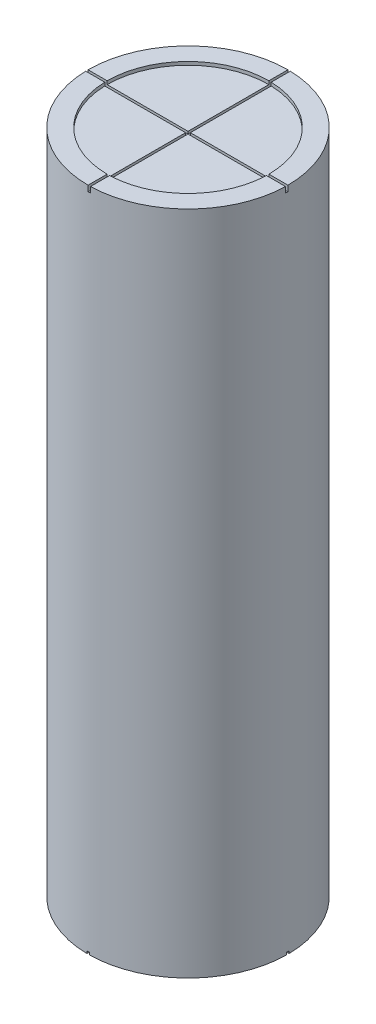
ISO-10303-21;
HEADER;
FILE_DESCRIPTION(('STEP AP214'),'2;1');
FILE_NAME('part.step','',(''),(''),'','','');
FILE_SCHEMA(('AUTOMOTIVE_DESIGN { 1 0 10303 214 1 1 1 1 }'));
ENDSEC;
DATA;
#1=APPLICATION_CONTEXT('core data for automotive mechanical design processes');
#2=APPLICATION_PROTOCOL_DEFINITION('international standard','automotive_design',2000,#1);
#3=PRODUCT_CONTEXT('',#1,'mechanical');
#4=PRODUCT('Part','Part','',(#3));
#5=PRODUCT_RELATED_PRODUCT_CATEGORY('part','',(#4));
#6=PRODUCT_DEFINITION_FORMATION('','',#4);
#7=PRODUCT_DEFINITION_CONTEXT('part definition',#1,'design');
#8=PRODUCT_DEFINITION('design','',#6,#7);
#9=PRODUCT_DEFINITION_SHAPE('','',#8);
#10=(LENGTH_UNIT() NAMED_UNIT(*) SI_UNIT(.MILLI.,.METRE.));
#11=(NAMED_UNIT(*) PLANE_ANGLE_UNIT() SI_UNIT($,.RADIAN.));
#12=(NAMED_UNIT(*) SI_UNIT($,.STERADIAN.) SOLID_ANGLE_UNIT());
#13=UNCERTAINTY_MEASURE_WITH_UNIT(LENGTH_MEASURE(1.E-05),#10,'distance_accuracy_value','');
#14=(GEOMETRIC_REPRESENTATION_CONTEXT(3) GLOBAL_UNCERTAINTY_ASSIGNED_CONTEXT((#13)) GLOBAL_UNIT_ASSIGNED_CONTEXT((#10,
#11,#12)) REPRESENTATION_CONTEXT('',''));
#15=CARTESIAN_POINT('',(0.,0.,0.));
#16=DIRECTION('',(0.,0.,1.));
#17=DIRECTION('',(1.,0.,0.));
#18=AXIS2_PLACEMENT_3D('',#15,#16,#17);
#19=CARTESIAN_POINT('',(0.,70.,0.));
#20=DIRECTION('',(0.,-1.,0.));
#21=DIRECTION('',(0.,0.,-1.));
#22=AXIS2_PLACEMENT_3D('',#19,#20,#21);
#23=CYLINDRICAL_SURFACE('',#22,10.5);
#24=DIRECTION('',(0.,-1.,0.));
#25=VECTOR('',#24,1.);
#26=CARTESIAN_POINT('',(10.4992559260169,70.,0.125));
#27=LINE('',#26,#25);
#28=CARTESIAN_POINT('',(10.4992559260169,0.25,0.125));
#29=VERTEX_POINT('',#28);
#30=CARTESIAN_POINT('',(10.4992559260169,0.,0.125));
#31=VERTEX_POINT('',#30);
#32=EDGE_CURVE('E480',#29,#31,#27,.T.);
#33=ORIENTED_EDGE('',*,*,#32,.F.);
#34=CARTESIAN_POINT('',(0.,0.25,0.));
#35=DIRECTION('',(0.,-1.,0.));
#36=DIRECTION('',(0.,0.,-1.));
#37=AXIS2_PLACEMENT_3D('',#34,#35,#36);
#38=CIRCLE('',#37,10.5);
#39=CARTESIAN_POINT('',(10.4992559260169,0.25,-0.125));
#40=VERTEX_POINT('',#39);
#41=EDGE_CURVE('E523',#40,#29,#38,.T.);
#42=ORIENTED_EDGE('',*,*,#41,.F.);
#43=DIRECTION('',(0.,-1.,0.));
#44=VECTOR('',#43,1.);
#45=CARTESIAN_POINT('',(10.4992559260169,70.,-0.125));
#46=LINE('',#45,#44);
#47=CARTESIAN_POINT('',(10.4992559260169,0.,-0.125));
#48=VERTEX_POINT('',#47);
#49=EDGE_CURVE('E476',#40,#48,#46,.T.);
#50=ORIENTED_EDGE('',*,*,#49,.T.);
#51=CARTESIAN_POINT('',(0.,0.,0.));
#52=DIRECTION('',(0.,1.,0.));
#53=DIRECTION('',(0.,0.,1.));
#54=AXIS2_PLACEMENT_3D('',#51,#52,#53);
#55=CIRCLE('',#54,10.5);
#56=CARTESIAN_POINT('',(0.125,0.,-10.4992559260169));
#57=VERTEX_POINT('',#56);
#58=EDGE_CURVE('E635',#48,#57,#55,.T.);
#59=ORIENTED_EDGE('',*,*,#58,.T.);
#60=DIRECTION('',(0.,-1.,0.));
#61=VECTOR('',#60,1.);
#62=CARTESIAN_POINT('',(0.125,70.,-10.4992559260169));
#63=LINE('',#62,#61);
#64=CARTESIAN_POINT('',(0.125,0.25,-10.4992559260169));
#65=VERTEX_POINT('',#64);
#66=EDGE_CURVE('E461',#65,#57,#63,.T.);
#67=ORIENTED_EDGE('',*,*,#66,.F.);
#68=CARTESIAN_POINT('',(-0.125,0.25,-10.4992559260169));
#69=VERTEX_POINT('',#68);
#70=EDGE_CURVE('E522',#69,#65,#38,.T.);
#71=ORIENTED_EDGE('',*,*,#70,.F.);
#72=DIRECTION('',(0.,-1.,0.));
#73=VECTOR('',#72,1.);
#74=CARTESIAN_POINT('',(-0.125,70.,-10.4992559260169));
#75=LINE('',#74,#73);
#76=CARTESIAN_POINT('',(-0.125,0.,-10.4992559260169));
#77=VERTEX_POINT('',#76);
#78=EDGE_CURVE('E464',#69,#77,#75,.T.);
#79=ORIENTED_EDGE('',*,*,#78,.T.);
#80=CARTESIAN_POINT('',(-10.4992559260169,0.,-0.125));
#81=VERTEX_POINT('',#80);
#82=EDGE_CURVE('E505',#77,#81,#55,.T.);
#83=ORIENTED_EDGE('',*,*,#82,.T.);
#84=DIRECTION('',(0.,-1.,0.));
#85=VECTOR('',#84,1.);
#86=CARTESIAN_POINT('',(-10.4992559260169,70.,-0.125));
#87=LINE('',#86,#85);
#88=CARTESIAN_POINT('',(-10.4992559260169,0.25,-0.125));
#89=VERTEX_POINT('',#88);
#90=EDGE_CURVE('E468',#81,#89,#87,.F.);
#91=ORIENTED_EDGE('',*,*,#90,.T.);
#92=CARTESIAN_POINT('',(-10.4992559260169,0.25,0.125));
#93=VERTEX_POINT('',#92);
#94=EDGE_CURVE('E705',#93,#89,#38,.T.);
#95=ORIENTED_EDGE('',*,*,#94,.F.);
#96=DIRECTION('',(0.,-1.,0.));
#97=VECTOR('',#96,1.);
#98=CARTESIAN_POINT('',(-10.4992559260169,70.,0.125));
#99=LINE('',#98,#97);
#100=CARTESIAN_POINT('',(-10.4992559260169,0.,0.125));
#101=VERTEX_POINT('',#100);
#102=EDGE_CURVE('E472',#101,#93,#99,.F.);
#103=ORIENTED_EDGE('',*,*,#102,.F.);
#104=CARTESIAN_POINT('',(-0.125,0.,10.4992559260169));
#105=VERTEX_POINT('',#104);
#106=EDGE_CURVE('E501',#101,#105,#55,.T.);
#107=ORIENTED_EDGE('',*,*,#106,.T.);
#108=DIRECTION('',(0.,-1.,0.));
#109=VECTOR('',#108,1.);
#110=CARTESIAN_POINT('',(-0.125,70.,10.4992559260169));
#111=LINE('',#110,#109);
#112=CARTESIAN_POINT('',(-0.125,0.25,10.4992559260169));
#113=VERTEX_POINT('',#112);
#114=EDGE_CURVE('E111',#105,#113,#111,.F.);
#115=ORIENTED_EDGE('',*,*,#114,.T.);
#116=CARTESIAN_POINT('',(0.125,0.25,10.4992559260169));
#117=VERTEX_POINT('',#116);
#118=EDGE_CURVE('E519',#117,#113,#38,.T.);
#119=ORIENTED_EDGE('',*,*,#118,.F.);
#120=DIRECTION('',(0.,-1.,0.));
#121=VECTOR('',#120,1.);
#122=CARTESIAN_POINT('',(0.125,70.,10.4992559260169));
#123=LINE('',#122,#121);
#124=CARTESIAN_POINT('',(0.125,0.,10.4992559260169));
#125=VERTEX_POINT('',#124);
#126=EDGE_CURVE('E457',#125,#117,#123,.F.);
#127=ORIENTED_EDGE('',*,*,#126,.F.);
#128=EDGE_CURVE('E499',#125,#31,#55,.T.);
#129=ORIENTED_EDGE('',*,*,#128,.T.);
#130=EDGE_LOOP('',(#33,#42,#50,#59,#67,#71,#79,#83,#91,#95,#103,#107,#115,#119,#127,#129));
#131=FACE_BOUND('',#130,.T.);
#132=DIRECTION('',(0.,-1.,0.));
#133=VECTOR('',#132,1.);
#134=CARTESIAN_POINT('',(10.4970233876085,70.,0.25));
#135=LINE('',#134,#133);
#136=CARTESIAN_POINT('',(10.4970233876085,70.,0.25));
#137=VERTEX_POINT('',#136);
#138=CARTESIAN_POINT('',(10.4970233876085,69.4,0.25));
#139=VERTEX_POINT('',#138);
#140=EDGE_CURVE('E401',#137,#139,#135,.T.);
#141=ORIENTED_EDGE('',*,*,#140,.F.);
#142=CARTESIAN_POINT('',(0.,70.,0.));
#143=DIRECTION('',(0.,1.,0.));
#144=DIRECTION('',(0.,0.,1.));
#145=AXIS2_PLACEMENT_3D('',#142,#143,#144);
#146=CIRCLE('',#145,10.5);
#147=CARTESIAN_POINT('',(0.25,70.,10.4970233876085));
#148=VERTEX_POINT('',#147);
#149=EDGE_CURVE('E500',#148,#137,#146,.T.);
#150=ORIENTED_EDGE('',*,*,#149,.F.);
#151=DIRECTION('',(0.,-1.,0.));
#152=VECTOR('',#151,1.);
#153=CARTESIAN_POINT('',(0.25,70.,10.4970233876085));
#154=LINE('',#153,#152);
#155=CARTESIAN_POINT('',(0.25,69.4,10.4970233876085));
#156=VERTEX_POINT('',#155);
#157=EDGE_CURVE('E385',#156,#148,#154,.F.);
#158=ORIENTED_EDGE('',*,*,#157,.F.);
#159=CARTESIAN_POINT('',(0.,69.4,0.));
#160=DIRECTION('',(0.,-1.,0.));
#161=DIRECTION('',(0.,0.,-1.));
#162=AXIS2_PLACEMENT_3D('',#159,#160,#161);
#163=CIRCLE('',#162,10.5);
#164=CARTESIAN_POINT('',(0.,69.4,10.5));
#165=VERTEX_POINT('',#164);
#166=EDGE_CURVE('E308',#156,#165,#163,.T.);
#167=ORIENTED_EDGE('',*,*,#166,.T.);
#168=DIRECTION('',(0.,1.,0.));
#169=VECTOR('',#168,1.);
#170=CARTESIAN_POINT('',(0.,69.4,10.5));
#171=LINE('',#170,#169);
#172=CARTESIAN_POINT('',(0.,70.,10.5));
#173=VERTEX_POINT('',#172);
#174=EDGE_CURVE('E326',#165,#173,#171,.T.);
#175=ORIENTED_EDGE('',*,*,#174,.T.);
#176=CARTESIAN_POINT('',(-10.4970233876085,70.,0.25));
#177=VERTEX_POINT('',#176);
#178=EDGE_CURVE('E495',#177,#173,#146,.T.);
#179=ORIENTED_EDGE('',*,*,#178,.F.);
#180=DIRECTION('',(0.,-1.,0.));
#181=VECTOR('',#180,1.);
#182=CARTESIAN_POINT('',(-10.4970233876085,70.,0.25));
#183=LINE('',#182,#181);
#184=CARTESIAN_POINT('',(-10.4970233876085,69.4,0.25));
#185=VERTEX_POINT('',#184);
#186=EDGE_CURVE('E391',#185,#177,#183,.F.);
#187=ORIENTED_EDGE('',*,*,#186,.F.);
#188=CARTESIAN_POINT('',(-10.5,69.4,0.));
#189=VERTEX_POINT('',#188);
#190=EDGE_CURVE('E96',#185,#189,#163,.T.);
#191=ORIENTED_EDGE('',*,*,#190,.T.);
#192=DIRECTION('',(0.,1.,0.));
#193=VECTOR('',#192,1.);
#194=CARTESIAN_POINT('',(-10.5,69.4,0.));
#195=LINE('',#194,#193);
#196=CARTESIAN_POINT('',(-10.5,70.,0.));
#197=VERTEX_POINT('',#196);
#198=EDGE_CURVE('E363',#189,#197,#195,.T.);
#199=ORIENTED_EDGE('',*,*,#198,.T.);
#200=CARTESIAN_POINT('',(0.,70.,-10.5));
#201=VERTEX_POINT('',#200);
#202=EDGE_CURVE('E324',#201,#197,#146,.T.);
#203=ORIENTED_EDGE('',*,*,#202,.F.);
#204=DIRECTION('',(0.,1.,0.));
#205=VECTOR('',#204,1.);
#206=CARTESIAN_POINT('',(0.,69.4,-10.5));
#207=LINE('',#206,#205);
#208=CARTESIAN_POINT('',(0.,69.4,-10.5));
#209=VERTEX_POINT('',#208);
#210=EDGE_CURVE('E312',#209,#201,#207,.T.);
#211=ORIENTED_EDGE('',*,*,#210,.F.);
#212=CARTESIAN_POINT('',(0.25,69.4,-10.4970233876085));
#213=VERTEX_POINT('',#212);
#214=EDGE_CURVE('E90',#209,#213,#163,.T.);
#215=ORIENTED_EDGE('',*,*,#214,.T.);
#216=DIRECTION('',(0.,-1.,0.));
#217=VECTOR('',#216,1.);
#218=CARTESIAN_POINT('',(0.25,70.,-10.4970233876085));
#219=LINE('',#218,#217);
#220=CARTESIAN_POINT('',(0.25,70.,-10.4970233876085));
#221=VERTEX_POINT('',#220);
#222=EDGE_CURVE('E371',#221,#213,#219,.T.);
#223=ORIENTED_EDGE('',*,*,#222,.F.);
#224=CARTESIAN_POINT('',(10.5,70.,0.));
#225=VERTEX_POINT('',#224);
#226=EDGE_CURVE('E625',#225,#221,#146,.T.);
#227=ORIENTED_EDGE('',*,*,#226,.F.);
#228=DIRECTION('',(0.,1.,0.));
#229=VECTOR('',#228,1.);
#230=CARTESIAN_POINT('',(10.5,69.4,0.));
#231=LINE('',#230,#229);
#232=CARTESIAN_POINT('',(10.5,69.4,0.));
#233=VERTEX_POINT('',#232);
#234=EDGE_CURVE('E354',#233,#225,#231,.T.);
#235=ORIENTED_EDGE('',*,*,#234,.F.);
#236=EDGE_CURVE('E12',#233,#139,#163,.T.);
#237=ORIENTED_EDGE('',*,*,#236,.T.);
#238=EDGE_LOOP('',(#141,#150,#158,#167,#175,#179,#187,#191,#199,#203,#211,#215,#223,#227,#235,#237));
#239=FACE_BOUND('',#238,.T.);
#240=ADVANCED_FACE('F87',(#131,#239),#23,.T.);
#241=CARTESIAN_POINT('',(0.,70.,0.));
#242=DIRECTION('',(0.,1.,0.));
#243=DIRECTION('',(0.,0.,1.));
#244=AXIS2_PLACEMENT_3D('',#241,#242,#243);
#245=PLANE('',#244);
#246=ORIENTED_EDGE('',*,*,#149,.T.);
#247=DIRECTION('',(-1.,0.,0.));
#248=VECTOR('',#247,1.);
#249=CARTESIAN_POINT('',(0.,70.,0.25));
#250=LINE('',#249,#248);
#251=CARTESIAN_POINT('',(8.49632273398321,70.,0.25));
#252=VERTEX_POINT('',#251);
#253=EDGE_CURVE('E355',#137,#252,#250,.T.);
#254=ORIENTED_EDGE('',*,*,#253,.T.);
#255=CARTESIAN_POINT('',(0.,70.,0.));
#256=DIRECTION('',(0.,1.,0.));
#257=DIRECTION('',(0.,0.,1.));
#258=AXIS2_PLACEMENT_3D('',#255,#256,#257);
#259=CIRCLE('',#258,8.5);
#260=CARTESIAN_POINT('',(0.25,70.,8.49632273398321));
#261=VERTEX_POINT('',#260);
#262=EDGE_CURVE('E489',#261,#252,#259,.T.);
#263=ORIENTED_EDGE('',*,*,#262,.F.);
#264=DIRECTION('',(0.,0.,1.));
#265=VECTOR('',#264,1.);
#266=CARTESIAN_POINT('',(0.25,70.,0.));
#267=LINE('',#266,#265);
#268=EDGE_CURVE('E610',#261,#148,#267,.T.);
#269=ORIENTED_EDGE('',*,*,#268,.T.);
#270=EDGE_LOOP('',(#246,#254,#263,#269));
#271=FACE_BOUND('',#270,.T.);
#272=ADVANCED_FACE('F672',(#271),#245,.T.);
#273=CARTESIAN_POINT('',(-8.49632273398321,70.,0.25));
#274=VERTEX_POINT('',#273);
#275=CARTESIAN_POINT('',(0.,70.,8.5));
#276=VERTEX_POINT('',#275);
#277=EDGE_CURVE('E483',#274,#276,#259,.T.);
#278=ORIENTED_EDGE('',*,*,#277,.F.);
#279=EDGE_CURVE('E345',#274,#177,#250,.T.);
#280=ORIENTED_EDGE('',*,*,#279,.T.);
#281=ORIENTED_EDGE('',*,*,#178,.T.);
#282=DIRECTION('',(0.,0.,1.));
#283=VECTOR('',#282,1.);
#284=CARTESIAN_POINT('',(0.,70.,0.));
#285=LINE('',#284,#283);
#286=EDGE_CURVE('E603',#276,#173,#285,.T.);
#287=ORIENTED_EDGE('',*,*,#286,.F.);
#288=EDGE_LOOP('',(#278,#280,#281,#287));
#289=FACE_BOUND('',#288,.T.);
#290=ADVANCED_FACE('F591',(#289),#245,.T.);
#291=DIRECTION('',(-1.,0.,0.));
#292=VECTOR('',#291,1.);
#293=CARTESIAN_POINT('',(0.,70.,0.));
#294=LINE('',#293,#292);
#295=CARTESIAN_POINT('',(8.5,70.,0.));
#296=VERTEX_POINT('',#295);
#297=EDGE_CURVE('E360',#225,#296,#294,.T.);
#298=ORIENTED_EDGE('',*,*,#297,.F.);
#299=ORIENTED_EDGE('',*,*,#226,.T.);
#300=CARTESIAN_POINT('',(0.25,70.,-8.49632273398321));
#301=VERTEX_POINT('',#300);
#302=EDGE_CURVE('E605',#221,#301,#267,.T.);
#303=ORIENTED_EDGE('',*,*,#302,.T.);
#304=EDGE_CURVE('E565',#296,#301,#259,.T.);
#305=ORIENTED_EDGE('',*,*,#304,.F.);
#306=EDGE_LOOP('',(#298,#299,#303,#305));
#307=FACE_BOUND('',#306,.T.);
#308=ADVANCED_FACE('F668',(#307),#245,.T.);
#309=CARTESIAN_POINT('',(0.,69.65,0.));
#310=DIRECTION('',(0.,1.,0.));
#311=DIRECTION('',(0.,0.,1.));
#312=AXIS2_PLACEMENT_3D('',#309,#310,#311);
#313=CYLINDRICAL_SURFACE('',#312,8.5);
#314=DIRECTION('',(0.,1.,0.));
#315=VECTOR('',#314,1.);
#316=CARTESIAN_POINT('',(8.49632273398321,69.65,0.25));
#317=LINE('',#316,#315);
#318=CARTESIAN_POINT('',(8.49632273398321,69.65,0.25));
#319=VERTEX_POINT('',#318);
#320=EDGE_CURVE('E398',#319,#252,#317,.T.);
#321=ORIENTED_EDGE('',*,*,#320,.F.);
#322=CARTESIAN_POINT('',(0.,69.65,0.));
#323=DIRECTION('',(0.,1.,0.));
#324=DIRECTION('',(0.,0.,1.));
#325=AXIS2_PLACEMENT_3D('',#322,#323,#324);
#326=CIRCLE('',#325,8.5);
#327=CARTESIAN_POINT('',(0.25,69.65,8.49632273398321));
#328=VERTEX_POINT('',#327);
#329=EDGE_CURVE('E490',#328,#319,#326,.T.);
#330=ORIENTED_EDGE('',*,*,#329,.F.);
#331=DIRECTION('',(0.,1.,0.));
#332=VECTOR('',#331,1.);
#333=CARTESIAN_POINT('',(0.25,69.65,8.49632273398321));
#334=LINE('',#333,#332);
#335=EDGE_CURVE('E382',#261,#328,#334,.F.);
#336=ORIENTED_EDGE('',*,*,#335,.F.);
#337=ORIENTED_EDGE('',*,*,#262,.T.);
#338=EDGE_LOOP('',(#321,#330,#336,#337));
#339=FACE_BOUND('',#338,.T.);
#340=ADVANCED_FACE('F559',(#339),#313,.F.);
#341=DIRECTION('',(0.,1.,0.));
#342=VECTOR('',#341,1.);
#343=CARTESIAN_POINT('',(-8.49632273398321,69.65,0.25));
#344=LINE('',#343,#342);
#345=CARTESIAN_POINT('',(-8.49632273398321,69.65,0.25));
#346=VERTEX_POINT('',#345);
#347=EDGE_CURVE('E388',#274,#346,#344,.F.);
#348=ORIENTED_EDGE('',*,*,#347,.F.);
#349=ORIENTED_EDGE('',*,*,#277,.T.);
#350=DIRECTION('',(0.,1.,0.));
#351=VECTOR('',#350,1.);
#352=CARTESIAN_POINT('',(0.,69.65,8.5));
#353=LINE('',#352,#351);
#354=CARTESIAN_POINT('',(0.,69.65,8.5));
#355=VERTEX_POINT('',#354);
#356=EDGE_CURVE('E378',#276,#355,#353,.F.);
#357=ORIENTED_EDGE('',*,*,#356,.T.);
#358=EDGE_CURVE('E484',#346,#355,#326,.T.);
#359=ORIENTED_EDGE('',*,*,#358,.F.);
#360=EDGE_LOOP('',(#348,#349,#357,#359));
#361=FACE_BOUND('',#360,.T.);
#362=ADVANCED_FACE('F660',(#361),#313,.F.);
#363=CARTESIAN_POINT('',(8.5,69.65,0.));
#364=VERTEX_POINT('',#363);
#365=CARTESIAN_POINT('',(0.25,69.65,-8.49632273398321));
#366=VERTEX_POINT('',#365);
#367=EDGE_CURVE('E641',#364,#366,#326,.T.);
#368=ORIENTED_EDGE('',*,*,#367,.F.);
#369=DIRECTION('',(0.,1.,0.));
#370=VECTOR('',#369,1.);
#371=CARTESIAN_POINT('',(8.5,69.65,0.));
#372=LINE('',#371,#370);
#373=EDGE_CURVE('E404',#364,#296,#372,.T.);
#374=ORIENTED_EDGE('',*,*,#373,.T.);
#375=ORIENTED_EDGE('',*,*,#304,.T.);
#376=DIRECTION('',(0.,1.,0.));
#377=VECTOR('',#376,1.);
#378=CARTESIAN_POINT('',(0.25,69.65,-8.49632273398321));
#379=LINE('',#378,#377);
#380=EDGE_CURVE('E366',#366,#301,#379,.T.);
#381=ORIENTED_EDGE('',*,*,#380,.F.);
#382=EDGE_LOOP('',(#368,#374,#375,#381));
#383=FACE_BOUND('',#382,.T.);
#384=ADVANCED_FACE('F662',(#383),#313,.F.);
#385=CARTESIAN_POINT('',(0.,69.65,0.));
#386=DIRECTION('',(0.,1.,0.));
#387=DIRECTION('',(0.,0.,1.));
#388=AXIS2_PLACEMENT_3D('',#385,#386,#387);
#389=PLANE('',#388);
#390=ORIENTED_EDGE('',*,*,#329,.T.);
#391=DIRECTION('',(-1.,0.,0.));
#392=VECTOR('',#391,1.);
#393=CARTESIAN_POINT('',(0.,69.65,0.25));
#394=LINE('',#393,#392);
#395=CARTESIAN_POINT('',(0.25,69.65,0.25));
#396=VERTEX_POINT('',#395);
#397=EDGE_CURVE('E309',#319,#396,#394,.T.);
#398=ORIENTED_EDGE('',*,*,#397,.T.);
#399=DIRECTION('',(0.,0.,1.));
#400=VECTOR('',#399,1.);
#401=CARTESIAN_POINT('',(0.25,69.65,0.));
#402=LINE('',#401,#400);
#403=EDGE_CURVE('E544',#396,#328,#402,.T.);
#404=ORIENTED_EDGE('',*,*,#403,.T.);
#405=EDGE_LOOP('',(#390,#398,#404));
#406=FACE_BOUND('',#405,.T.);
#407=ADVANCED_FACE('F551',(#406),#389,.T.);
#408=DIRECTION('',(0.,0.,1.));
#409=VECTOR('',#408,1.);
#410=CARTESIAN_POINT('',(0.,69.65,0.));
#411=LINE('',#410,#409);
#412=CARTESIAN_POINT('',(0.,69.65,0.25));
#413=VERTEX_POINT('',#412);
#414=EDGE_CURVE('E537',#413,#355,#411,.T.);
#415=ORIENTED_EDGE('',*,*,#414,.F.);
#416=DIRECTION('',(-1.,0.,0.));
#417=VECTOR('',#416,1.);
#418=CARTESIAN_POINT('',(0.,69.65,0.25));
#419=LINE('',#418,#417);
#420=EDGE_CURVE('E540',#413,#346,#419,.T.);
#421=ORIENTED_EDGE('',*,*,#420,.T.);
#422=ORIENTED_EDGE('',*,*,#358,.T.);
#423=EDGE_LOOP('',(#415,#421,#422));
#424=FACE_BOUND('',#423,.T.);
#425=ADVANCED_FACE('F657',(#424),#389,.T.);
#426=DIRECTION('',(-1.,0.,0.));
#427=VECTOR('',#426,1.);
#428=CARTESIAN_POINT('',(0.,69.65,0.));
#429=LINE('',#428,#427);
#430=CARTESIAN_POINT('',(0.,69.65,0.));
#431=VERTEX_POINT('',#430);
#432=CARTESIAN_POINT('',(-8.5,69.65,0.));
#433=VERTEX_POINT('',#432);
#434=EDGE_CURVE('E534',#431,#433,#429,.T.);
#435=ORIENTED_EDGE('',*,*,#434,.F.);
#436=DIRECTION('',(0.,0.,1.));
#437=VECTOR('',#436,1.);
#438=CARTESIAN_POINT('',(0.,69.65,0.));
#439=LINE('',#438,#437);
#440=CARTESIAN_POINT('',(0.,69.65,-8.5));
#441=VERTEX_POINT('',#440);
#442=EDGE_CURVE('E531',#441,#431,#439,.T.);
#443=ORIENTED_EDGE('',*,*,#442,.F.);
#444=EDGE_CURVE('E488',#441,#433,#326,.T.);
#445=ORIENTED_EDGE('',*,*,#444,.T.);
#446=EDGE_LOOP('',(#435,#443,#445));
#447=FACE_BOUND('',#446,.T.);
#448=ADVANCED_FACE('F647',(#447),#389,.T.);
#449=CARTESIAN_POINT('',(0.,0.,0.));
#450=DIRECTION('',(0.,1.,0.));
#451=DIRECTION('',(0.,0.,1.));
#452=AXIS2_PLACEMENT_3D('',#449,#450,#451);
#453=PLANE('',#452);
#454=DIRECTION('',(0.,0.,-1.));
#455=VECTOR('',#454,1.);
#456=CARTESIAN_POINT('',(-0.125,0.,10.5));
#457=LINE('',#456,#455);
#458=CARTESIAN_POINT('',(-0.125,0.,-0.125));
#459=VERTEX_POINT('',#458);
#460=EDGE_CURVE('E422',#459,#77,#457,.T.);
#461=ORIENTED_EDGE('',*,*,#460,.F.);
#462=DIRECTION('',(-1.,0.,0.));
#463=VECTOR('',#462,1.);
#464=CARTESIAN_POINT('',(0.,0.,-0.125));
#465=LINE('',#464,#463);
#466=EDGE_CURVE('E515',#459,#81,#465,.T.);
#467=ORIENTED_EDGE('',*,*,#466,.T.);
#468=ORIENTED_EDGE('',*,*,#82,.F.);
#469=EDGE_LOOP('',(#461,#467,#468));
#470=FACE_BOUND('',#469,.T.);
#471=ADVANCED_FACE('F717',(#470),#453,.F.);
#472=DIRECTION('',(1.,0.,0.));
#473=VECTOR('',#472,1.);
#474=CARTESIAN_POINT('',(-10.5,0.,0.125));
#475=LINE('',#474,#473);
#476=CARTESIAN_POINT('',(0.125,0.,0.125));
#477=VERTEX_POINT('',#476);
#478=EDGE_CURVE('E440',#477,#31,#475,.T.);
#479=ORIENTED_EDGE('',*,*,#478,.T.);
#480=ORIENTED_EDGE('',*,*,#128,.F.);
#481=DIRECTION('',(0.,0.,1.));
#482=VECTOR('',#481,1.);
#483=CARTESIAN_POINT('',(0.125,0.,0.));
#484=LINE('',#483,#482);
#485=EDGE_CURVE('E512',#477,#125,#484,.T.);
#486=ORIENTED_EDGE('',*,*,#485,.F.);
#487=EDGE_LOOP('',(#479,#480,#486));
#488=FACE_BOUND('',#487,.T.);
#489=ADVANCED_FACE('F688',(#488),#453,.F.);
#490=DIRECTION('',(-1.,0.,0.));
#491=VECTOR('',#490,1.);
#492=CARTESIAN_POINT('',(0.,0.,0.125));
#493=LINE('',#492,#491);
#494=CARTESIAN_POINT('',(-0.125,0.,0.125));
#495=VERTEX_POINT('',#494);
#496=EDGE_CURVE('E509',#495,#101,#493,.T.);
#497=ORIENTED_EDGE('',*,*,#496,.F.);
#498=DIRECTION('',(0.,0.,1.));
#499=VECTOR('',#498,1.);
#500=CARTESIAN_POINT('',(-0.125,0.,0.));
#501=LINE('',#500,#499);
#502=EDGE_CURVE('E506',#495,#105,#501,.T.);
#503=ORIENTED_EDGE('',*,*,#502,.T.);
#504=ORIENTED_EDGE('',*,*,#106,.F.);
#505=EDGE_LOOP('',(#497,#503,#504));
#506=FACE_BOUND('',#505,.T.);
#507=ADVANCED_FACE('F704',(#506),#453,.F.);
#508=CARTESIAN_POINT('',(-8.5,70.,0.));
#509=VERTEX_POINT('',#508);
#510=EDGE_CURVE('E359',#509,#197,#294,.T.);
#511=ORIENTED_EDGE('',*,*,#510,.F.);
#512=CARTESIAN_POINT('',(0.,70.,-8.5));
#513=VERTEX_POINT('',#512);
#514=EDGE_CURVE('E494',#513,#509,#259,.T.);
#515=ORIENTED_EDGE('',*,*,#514,.F.);
#516=EDGE_CURVE('E581',#201,#513,#285,.T.);
#517=ORIENTED_EDGE('',*,*,#516,.F.);
#518=ORIENTED_EDGE('',*,*,#202,.T.);
#519=EDGE_LOOP('',(#511,#515,#517,#518));
#520=FACE_BOUND('',#519,.T.);
#521=ADVANCED_FACE('F580',(#520),#245,.T.);
#522=ORIENTED_EDGE('',*,*,#58,.F.);
#523=DIRECTION('',(1.,0.,0.));
#524=VECTOR('',#523,1.);
#525=CARTESIAN_POINT('',(-10.5,0.,-0.125));
#526=LINE('',#525,#524);
#527=CARTESIAN_POINT('',(0.125,0.,-0.125));
#528=VERTEX_POINT('',#527);
#529=EDGE_CURVE('E452',#528,#48,#526,.T.);
#530=ORIENTED_EDGE('',*,*,#529,.F.);
#531=DIRECTION('',(0.,0.,-1.));
#532=VECTOR('',#531,1.);
#533=CARTESIAN_POINT('',(0.125,0.,10.5));
#534=LINE('',#533,#532);
#535=EDGE_CURVE('E408',#528,#57,#534,.T.);
#536=ORIENTED_EDGE('',*,*,#535,.T.);
#537=EDGE_LOOP('',(#522,#530,#536));
#538=FACE_BOUND('',#537,.T.);
#539=ADVANCED_FACE('F731',(#538),#453,.F.);
#540=ORIENTED_EDGE('',*,*,#514,.T.);
#541=DIRECTION('',(0.,1.,0.));
#542=VECTOR('',#541,1.);
#543=CARTESIAN_POINT('',(-8.5,69.65,0.));
#544=LINE('',#543,#542);
#545=EDGE_CURVE('E394',#509,#433,#544,.F.);
#546=ORIENTED_EDGE('',*,*,#545,.T.);
#547=ORIENTED_EDGE('',*,*,#444,.F.);
#548=DIRECTION('',(0.,1.,0.));
#549=VECTOR('',#548,1.);
#550=CARTESIAN_POINT('',(0.,69.65,-8.5));
#551=LINE('',#550,#549);
#552=EDGE_CURVE('E374',#441,#513,#551,.T.);
#553=ORIENTED_EDGE('',*,*,#552,.T.);
#554=EDGE_LOOP('',(#540,#546,#547,#553));
#555=FACE_BOUND('',#554,.T.);
#556=ADVANCED_FACE('F575',(#555),#313,.F.);
#557=DIRECTION('',(-1.,0.,0.));
#558=VECTOR('',#557,1.);
#559=CARTESIAN_POINT('',(0.,69.65,0.));
#560=LINE('',#559,#558);
#561=CARTESIAN_POINT('',(0.25,69.65,0.));
#562=VERTEX_POINT('',#561);
#563=EDGE_CURVE('E528',#364,#562,#560,.T.);
#564=ORIENTED_EDGE('',*,*,#563,.F.);
#565=ORIENTED_EDGE('',*,*,#367,.T.);
#566=DIRECTION('',(0.,0.,1.));
#567=VECTOR('',#566,1.);
#568=CARTESIAN_POINT('',(0.25,69.65,0.));
#569=LINE('',#568,#567);
#570=EDGE_CURVE('E524',#366,#562,#569,.T.);
#571=ORIENTED_EDGE('',*,*,#570,.T.);
#572=EDGE_LOOP('',(#564,#565,#571));
#573=FACE_BOUND('',#572,.T.);
#574=ADVANCED_FACE('F766',(#573),#389,.T.);
#575=CARTESIAN_POINT('',(0.,0.25,0.));
#576=DIRECTION('',(0.,-1.,0.));
#577=DIRECTION('',(-1.,0.,0.));
#578=AXIS2_PLACEMENT_3D('',#575,#576,#577);
#579=PLANE('',#578);
#580=DIRECTION('',(1.,0.,0.));
#581=VECTOR('',#580,1.);
#582=CARTESIAN_POINT('',(-10.5,0.25,-0.125));
#583=LINE('',#582,#581);
#584=CARTESIAN_POINT('',(0.125,0.25,-0.125));
#585=VERTEX_POINT('',#584);
#586=EDGE_CURVE('E444',#585,#40,#583,.T.);
#587=ORIENTED_EDGE('',*,*,#586,.T.);
#588=ORIENTED_EDGE('',*,*,#41,.T.);
#589=DIRECTION('',(1.,0.,0.));
#590=VECTOR('',#589,1.);
#591=CARTESIAN_POINT('',(-10.5,0.25,0.125));
#592=LINE('',#591,#590);
#593=CARTESIAN_POINT('',(0.125,0.25,0.125));
#594=VERTEX_POINT('',#593);
#595=EDGE_CURVE('E445',#594,#29,#592,.T.);
#596=ORIENTED_EDGE('',*,*,#595,.F.);
#597=DIRECTION('',(0.,0.,-1.));
#598=VECTOR('',#597,1.);
#599=CARTESIAN_POINT('',(0.125,0.25,10.5));
#600=LINE('',#599,#598);
#601=EDGE_CURVE('E409',#117,#594,#600,.T.);
#602=ORIENTED_EDGE('',*,*,#601,.F.);
#603=ORIENTED_EDGE('',*,*,#118,.T.);
#604=DIRECTION('',(0.,0.,-1.));
#605=VECTOR('',#604,1.);
#606=CARTESIAN_POINT('',(-0.125,0.25,10.5));
#607=LINE('',#606,#605);
#608=CARTESIAN_POINT('',(-0.125,0.25,0.125));
#609=VERTEX_POINT('',#608);
#610=EDGE_CURVE('E414',#113,#609,#607,.T.);
#611=ORIENTED_EDGE('',*,*,#610,.T.);
#612=EDGE_CURVE('E441',#93,#609,#592,.T.);
#613=ORIENTED_EDGE('',*,*,#612,.F.);
#614=ORIENTED_EDGE('',*,*,#94,.T.);
#615=CARTESIAN_POINT('',(-0.125,0.25,-0.125));
#616=VERTEX_POINT('',#615);
#617=EDGE_CURVE('E446',#89,#616,#583,.T.);
#618=ORIENTED_EDGE('',*,*,#617,.T.);
#619=EDGE_CURVE('E412',#616,#69,#607,.T.);
#620=ORIENTED_EDGE('',*,*,#619,.T.);
#621=ORIENTED_EDGE('',*,*,#70,.T.);
#622=EDGE_CURVE('E413',#585,#65,#600,.T.);
#623=ORIENTED_EDGE('',*,*,#622,.F.);
#624=EDGE_LOOP('',(#587,#588,#596,#602,#603,#611,#613,#614,#618,#620,#621,#623));
#625=FACE_BOUND('',#624,.T.);
#626=ADVANCED_FACE('F694',(#625),#579,.T.);
#627=CARTESIAN_POINT('',(-10.5,0.25,0.125));
#628=DIRECTION('',(0.,0.,-1.));
#629=DIRECTION('',(-1.,0.,0.));
#630=AXIS2_PLACEMENT_3D('',#627,#628,#629);
#631=PLANE('',#630);
#632=ORIENTED_EDGE('',*,*,#32,.T.);
#633=ORIENTED_EDGE('',*,*,#478,.F.);
#634=DIRECTION('',(0.,1.,0.));
#635=VECTOR('',#634,1.);
#636=CARTESIAN_POINT('',(0.125,0.25,0.125));
#637=LINE('',#636,#635);
#638=EDGE_CURVE('E436',#477,#594,#637,.T.);
#639=ORIENTED_EDGE('',*,*,#638,.T.);
#640=ORIENTED_EDGE('',*,*,#595,.T.);
#641=EDGE_LOOP('',(#632,#633,#639,#640));
#642=FACE_BOUND('',#641,.T.);
#643=ADVANCED_FACE('F683',(#642),#631,.T.);
#644=CARTESIAN_POINT('',(-10.5,0.25,-0.125));
#645=DIRECTION('',(0.,0.,-1.));
#646=DIRECTION('',(-1.,0.,0.));
#647=AXIS2_PLACEMENT_3D('',#644,#645,#646);
#648=PLANE('',#647);
#649=ORIENTED_EDGE('',*,*,#586,.F.);
#650=DIRECTION('',(0.,1.,0.));
#651=VECTOR('',#650,1.);
#652=CARTESIAN_POINT('',(0.125,0.25,-0.125));
#653=LINE('',#652,#651);
#654=EDGE_CURVE('E432',#528,#585,#653,.T.);
#655=ORIENTED_EDGE('',*,*,#654,.F.);
#656=ORIENTED_EDGE('',*,*,#529,.T.);
#657=ORIENTED_EDGE('',*,*,#49,.F.);
#658=EDGE_LOOP('',(#649,#655,#656,#657));
#659=FACE_BOUND('',#658,.T.);
#660=ADVANCED_FACE('F733',(#659),#648,.F.);
#661=ORIENTED_EDGE('',*,*,#102,.T.);
#662=ORIENTED_EDGE('',*,*,#612,.T.);
#663=DIRECTION('',(0.,1.,0.));
#664=VECTOR('',#663,1.);
#665=CARTESIAN_POINT('',(-0.125,0.25,0.125));
#666=LINE('',#665,#664);
#667=EDGE_CURVE('E428',#495,#609,#666,.T.);
#668=ORIENTED_EDGE('',*,*,#667,.F.);
#669=ORIENTED_EDGE('',*,*,#496,.T.);
#670=EDGE_LOOP('',(#661,#662,#668,#669));
#671=FACE_BOUND('',#670,.T.);
#672=ADVANCED_FACE('F700',(#671),#631,.T.);
#673=ORIENTED_EDGE('',*,*,#466,.F.);
#674=DIRECTION('',(0.,1.,0.));
#675=VECTOR('',#674,1.);
#676=CARTESIAN_POINT('',(-0.125,0.25,-0.125));
#677=LINE('',#676,#675);
#678=EDGE_CURVE('E418',#459,#616,#677,.T.);
#679=ORIENTED_EDGE('',*,*,#678,.T.);
#680=ORIENTED_EDGE('',*,*,#617,.F.);
#681=ORIENTED_EDGE('',*,*,#90,.F.);
#682=EDGE_LOOP('',(#673,#679,#680,#681));
#683=FACE_BOUND('',#682,.T.);
#684=ADVANCED_FACE('F710',(#683),#648,.F.);
#685=CARTESIAN_POINT('',(-0.125,0.25,10.5));
#686=DIRECTION('',(-1.,0.,0.));
#687=DIRECTION('',(0.,0.,1.));
#688=AXIS2_PLACEMENT_3D('',#685,#686,#687);
#689=PLANE('',#688);
#690=ORIENTED_EDGE('',*,*,#619,.F.);
#691=ORIENTED_EDGE('',*,*,#678,.F.);
#692=ORIENTED_EDGE('',*,*,#460,.T.);
#693=ORIENTED_EDGE('',*,*,#78,.F.);
#694=EDGE_LOOP('',(#690,#691,#692,#693));
#695=FACE_BOUND('',#694,.T.);
#696=ADVANCED_FACE('F719',(#695),#689,.F.);
#697=CARTESIAN_POINT('',(0.125,0.25,10.5));
#698=DIRECTION('',(-1.,0.,0.));
#699=DIRECTION('',(0.,0.,1.));
#700=AXIS2_PLACEMENT_3D('',#697,#698,#699);
#701=PLANE('',#700);
#702=ORIENTED_EDGE('',*,*,#66,.T.);
#703=ORIENTED_EDGE('',*,*,#535,.F.);
#704=ORIENTED_EDGE('',*,*,#654,.T.);
#705=ORIENTED_EDGE('',*,*,#622,.T.);
#706=EDGE_LOOP('',(#702,#703,#704,#705));
#707=FACE_BOUND('',#706,.T.);
#708=ADVANCED_FACE('F725',(#707),#701,.T.);
#709=ORIENTED_EDGE('',*,*,#126,.T.);
#710=ORIENTED_EDGE('',*,*,#601,.T.);
#711=ORIENTED_EDGE('',*,*,#638,.F.);
#712=ORIENTED_EDGE('',*,*,#485,.T.);
#713=EDGE_LOOP('',(#709,#710,#711,#712));
#714=FACE_BOUND('',#713,.T.);
#715=ADVANCED_FACE('F690',(#714),#701,.T.);
#716=ORIENTED_EDGE('',*,*,#502,.F.);
#717=ORIENTED_EDGE('',*,*,#667,.T.);
#718=ORIENTED_EDGE('',*,*,#610,.F.);
#719=ORIENTED_EDGE('',*,*,#114,.F.);
#720=EDGE_LOOP('',(#716,#717,#718,#719));
#721=FACE_BOUND('',#720,.T.);
#722=ADVANCED_FACE('F696',(#721),#689,.F.);
#723=CARTESIAN_POINT('',(0.,69.4,0.));
#724=DIRECTION('',(0.,-1.,0.));
#725=DIRECTION('',(0.,0.,-1.));
#726=AXIS2_PLACEMENT_3D('',#723,#724,#725);
#727=PLANE('',#726);
#728=DIRECTION('',(0.,0.,1.));
#729=VECTOR('',#728,1.);
#730=CARTESIAN_POINT('',(0.,69.4,0.));
#731=LINE('',#730,#729);
#732=CARTESIAN_POINT('',(0.,69.4,0.));
#733=VERTEX_POINT('',#732);
#734=EDGE_CURVE('E300',#209,#733,#731,.T.);
#735=ORIENTED_EDGE('',*,*,#734,.T.);
#736=DIRECTION('',(-1.,0.,0.));
#737=VECTOR('',#736,1.);
#738=CARTESIAN_POINT('',(0.,69.4,0.));
#739=LINE('',#738,#737);
#740=EDGE_CURVE('E349',#733,#189,#739,.T.);
#741=ORIENTED_EDGE('',*,*,#740,.T.);
#742=ORIENTED_EDGE('',*,*,#190,.F.);
#743=DIRECTION('',(-1.,0.,0.));
#744=VECTOR('',#743,1.);
#745=CARTESIAN_POINT('',(0.,69.4,0.25));
#746=LINE('',#745,#744);
#747=CARTESIAN_POINT('',(0.,69.4,0.25));
#748=VERTEX_POINT('',#747);
#749=EDGE_CURVE('E350',#748,#185,#746,.T.);
#750=ORIENTED_EDGE('',*,*,#749,.F.);
#751=EDGE_CURVE('E318',#748,#165,#731,.T.);
#752=ORIENTED_EDGE('',*,*,#751,.T.);
#753=ORIENTED_EDGE('',*,*,#166,.F.);
#754=DIRECTION('',(0.,0.,1.));
#755=VECTOR('',#754,1.);
#756=CARTESIAN_POINT('',(0.25,69.4,0.));
#757=LINE('',#756,#755);
#758=CARTESIAN_POINT('',(0.25,69.4,0.25));
#759=VERTEX_POINT('',#758);
#760=EDGE_CURVE('E608',#759,#156,#757,.T.);
#761=ORIENTED_EDGE('',*,*,#760,.F.);
#762=EDGE_CURVE('E346',#139,#759,#746,.T.);
#763=ORIENTED_EDGE('',*,*,#762,.F.);
#764=ORIENTED_EDGE('',*,*,#236,.F.);
#765=CARTESIAN_POINT('',(0.25,69.4,0.));
#766=VERTEX_POINT('',#765);
#767=EDGE_CURVE('E351',#233,#766,#739,.T.);
#768=ORIENTED_EDGE('',*,*,#767,.T.);
#769=EDGE_CURVE('E303',#213,#766,#757,.T.);
#770=ORIENTED_EDGE('',*,*,#769,.F.);
#771=ORIENTED_EDGE('',*,*,#214,.F.);
#772=EDGE_LOOP('',(#735,#741,#742,#750,#752,#753,#761,#763,#764,#768,#770,#771));
#773=FACE_BOUND('',#772,.T.);
#774=ADVANCED_FACE('F299',(#773),#727,.F.);
#775=CARTESIAN_POINT('',(0.,69.4,0.));
#776=DIRECTION('',(0.,0.,-1.));
#777=DIRECTION('',(-1.,0.,0.));
#778=AXIS2_PLACEMENT_3D('',#775,#776,#777);
#779=PLANE('',#778);
#780=ORIENTED_EDGE('',*,*,#563,.T.);
#781=DIRECTION('',(0.,1.,0.));
#782=VECTOR('',#781,1.);
#783=CARTESIAN_POINT('',(0.25,69.4,0.));
#784=LINE('',#783,#782);
#785=EDGE_CURVE('E103',#766,#562,#784,.T.);
#786=ORIENTED_EDGE('',*,*,#785,.F.);
#787=ORIENTED_EDGE('',*,*,#767,.F.);
#788=ORIENTED_EDGE('',*,*,#234,.T.);
#789=ORIENTED_EDGE('',*,*,#297,.T.);
#790=ORIENTED_EDGE('',*,*,#373,.F.);
#791=EDGE_LOOP('',(#780,#786,#787,#788,#789,#790));
#792=FACE_BOUND('',#791,.T.);
#793=ADVANCED_FACE('F761',(#792),#779,.F.);
#794=CARTESIAN_POINT('',(0.,69.4,0.25));
#795=DIRECTION('',(0.,0.,-1.));
#796=DIRECTION('',(-1.,0.,0.));
#797=AXIS2_PLACEMENT_3D('',#794,#795,#796);
#798=PLANE('',#797);
#799=ORIENTED_EDGE('',*,*,#140,.T.);
#800=ORIENTED_EDGE('',*,*,#762,.T.);
#801=DIRECTION('',(0.,1.,0.));
#802=VECTOR('',#801,1.);
#803=CARTESIAN_POINT('',(0.25,69.4,0.25));
#804=LINE('',#803,#802);
#805=EDGE_CURVE('E330',#759,#396,#804,.T.);
#806=ORIENTED_EDGE('',*,*,#805,.T.);
#807=ORIENTED_EDGE('',*,*,#397,.F.);
#808=ORIENTED_EDGE('',*,*,#320,.T.);
#809=ORIENTED_EDGE('',*,*,#253,.F.);
#810=EDGE_LOOP('',(#799,#800,#806,#807,#808,#809));
#811=FACE_BOUND('',#810,.T.);
#812=ADVANCED_FACE('F555',(#811),#798,.T.);
#813=ORIENTED_EDGE('',*,*,#510,.T.);
#814=ORIENTED_EDGE('',*,*,#198,.F.);
#815=ORIENTED_EDGE('',*,*,#740,.F.);
#816=DIRECTION('',(0.,1.,0.));
#817=VECTOR('',#816,1.);
#818=CARTESIAN_POINT('',(0.,69.4,0.));
#819=LINE('',#818,#817);
#820=EDGE_CURVE('E315',#733,#431,#819,.T.);
#821=ORIENTED_EDGE('',*,*,#820,.T.);
#822=ORIENTED_EDGE('',*,*,#434,.T.);
#823=ORIENTED_EDGE('',*,*,#545,.F.);
#824=EDGE_LOOP('',(#813,#814,#815,#821,#822,#823));
#825=FACE_BOUND('',#824,.T.);
#826=ADVANCED_FACE('F648',(#825),#779,.F.);
#827=ORIENTED_EDGE('',*,*,#186,.T.);
#828=ORIENTED_EDGE('',*,*,#279,.F.);
#829=ORIENTED_EDGE('',*,*,#347,.T.);
#830=ORIENTED_EDGE('',*,*,#420,.F.);
#831=DIRECTION('',(0.,1.,0.));
#832=VECTOR('',#831,1.);
#833=CARTESIAN_POINT('',(0.,69.4,0.25));
#834=LINE('',#833,#832);
#835=EDGE_CURVE('E339',#748,#413,#834,.T.);
#836=ORIENTED_EDGE('',*,*,#835,.F.);
#837=ORIENTED_EDGE('',*,*,#749,.T.);
#838=EDGE_LOOP('',(#827,#828,#829,#830,#836,#837));
#839=FACE_BOUND('',#838,.T.);
#840=ADVANCED_FACE('F652',(#839),#798,.T.);
#841=CARTESIAN_POINT('',(0.25,69.4,0.));
#842=DIRECTION('',(-1.,0.,0.));
#843=DIRECTION('',(0.,0.,1.));
#844=AXIS2_PLACEMENT_3D('',#841,#842,#843);
#845=PLANE('',#844);
#846=ORIENTED_EDGE('',*,*,#157,.T.);
#847=ORIENTED_EDGE('',*,*,#268,.F.);
#848=ORIENTED_EDGE('',*,*,#335,.T.);
#849=ORIENTED_EDGE('',*,*,#403,.F.);
#850=ORIENTED_EDGE('',*,*,#805,.F.);
#851=ORIENTED_EDGE('',*,*,#760,.T.);
#852=EDGE_LOOP('',(#846,#847,#848,#849,#850,#851));
#853=FACE_BOUND('',#852,.T.);
#854=ADVANCED_FACE('F620',(#853),#845,.T.);
#855=CARTESIAN_POINT('',(0.,69.4,0.));
#856=DIRECTION('',(-1.,0.,0.));
#857=DIRECTION('',(0.,0.,1.));
#858=AXIS2_PLACEMENT_3D('',#855,#856,#857);
#859=PLANE('',#858);
#860=ORIENTED_EDGE('',*,*,#286,.T.);
#861=ORIENTED_EDGE('',*,*,#174,.F.);
#862=ORIENTED_EDGE('',*,*,#751,.F.);
#863=ORIENTED_EDGE('',*,*,#835,.T.);
#864=ORIENTED_EDGE('',*,*,#414,.T.);
#865=ORIENTED_EDGE('',*,*,#356,.F.);
#866=EDGE_LOOP('',(#860,#861,#862,#863,#864,#865));
#867=FACE_BOUND('',#866,.T.);
#868=ADVANCED_FACE('F602',(#867),#859,.F.);
#869=ORIENTED_EDGE('',*,*,#442,.T.);
#870=ORIENTED_EDGE('',*,*,#820,.F.);
#871=ORIENTED_EDGE('',*,*,#734,.F.);
#872=ORIENTED_EDGE('',*,*,#210,.T.);
#873=ORIENTED_EDGE('',*,*,#516,.T.);
#874=ORIENTED_EDGE('',*,*,#552,.F.);
#875=EDGE_LOOP('',(#869,#870,#871,#872,#873,#874));
#876=FACE_BOUND('',#875,.T.);
#877=ADVANCED_FACE('F311',(#876),#859,.F.);
#878=ORIENTED_EDGE('',*,*,#222,.T.);
#879=ORIENTED_EDGE('',*,*,#769,.T.);
#880=ORIENTED_EDGE('',*,*,#785,.T.);
#881=ORIENTED_EDGE('',*,*,#570,.F.);
#882=ORIENTED_EDGE('',*,*,#380,.T.);
#883=ORIENTED_EDGE('',*,*,#302,.F.);
#884=EDGE_LOOP('',(#878,#879,#880,#881,#882,#883));
#885=FACE_BOUND('',#884,.T.);
#886=ADVANCED_FACE('F959',(#885),#845,.T.);
#887=CLOSED_SHELL('',(#240,#272,#290,#308,#340,#362,#384,#407,#425,#448,#471,#489,#507,#521,
#539,#556,#574,#626,#643,#660,#672,#684,#696,#708,#715,#722,#774,#793,#812,#826,#840,#854,#868,
#877,#886));
#888=MANIFOLD_SOLID_BREP('B2',#887);
#889=ADVANCED_BREP_SHAPE_REPRESENTATION('',(#18,#888),#14);
#890=SHAPE_DEFINITION_REPRESENTATION(#9,#889);
ENDSEC;
END-ISO-10303-21;
